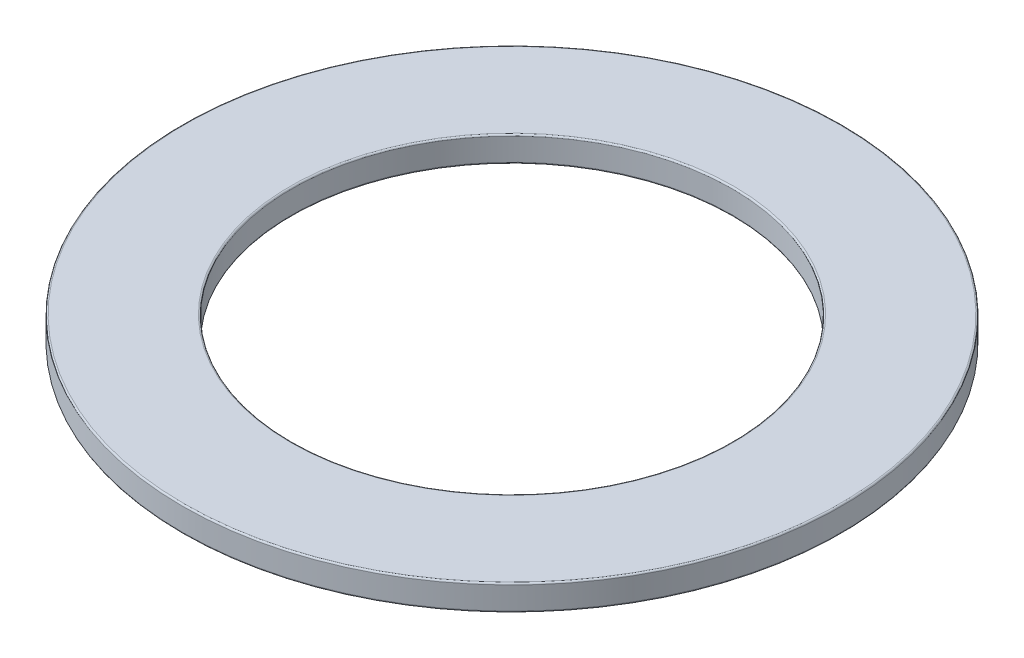
ISO-10303-21;
HEADER;
FILE_DESCRIPTION(('STEP AP214'),'2;1');
FILE_NAME('part.step','',(''),(''),'','','');
FILE_SCHEMA(('AUTOMOTIVE_DESIGN { 1 0 10303 214 1 1 1 1 }'));
ENDSEC;
DATA;
#1=APPLICATION_CONTEXT('core data for automotive mechanical design processes');
#2=APPLICATION_PROTOCOL_DEFINITION('international standard','automotive_design',2000,#1);
#3=PRODUCT_CONTEXT('',#1,'mechanical');
#4=PRODUCT('Part','Part','',(#3));
#5=PRODUCT_RELATED_PRODUCT_CATEGORY('part','',(#4));
#6=PRODUCT_DEFINITION_FORMATION('','',#4);
#7=PRODUCT_DEFINITION_CONTEXT('part definition',#1,'design');
#8=PRODUCT_DEFINITION('design','',#6,#7);
#9=PRODUCT_DEFINITION_SHAPE('','',#8);
#10=(LENGTH_UNIT() NAMED_UNIT(*) SI_UNIT(.MILLI.,.METRE.));
#11=(NAMED_UNIT(*) PLANE_ANGLE_UNIT() SI_UNIT($,.RADIAN.));
#12=(NAMED_UNIT(*) SI_UNIT($,.STERADIAN.) SOLID_ANGLE_UNIT());
#13=UNCERTAINTY_MEASURE_WITH_UNIT(LENGTH_MEASURE(1.E-05),#10,'distance_accuracy_value','');
#14=(GEOMETRIC_REPRESENTATION_CONTEXT(3) GLOBAL_UNCERTAINTY_ASSIGNED_CONTEXT((#13)) GLOBAL_UNIT_ASSIGNED_CONTEXT((#10,
#11,#12)) REPRESENTATION_CONTEXT('',''));
#15=CARTESIAN_POINT('',(0.,0.,0.));
#16=DIRECTION('',(0.,0.,1.));
#17=DIRECTION('',(1.,0.,0.));
#18=AXIS2_PLACEMENT_3D('',#15,#16,#17);
#19=CARTESIAN_POINT('',(0.,-5.5499,0.));
#20=DIRECTION('',(0.,-1.,0.));
#21=DIRECTION('',(0.,0.,-1.));
#22=AXIS2_PLACEMENT_3D('',#19,#20,#21);
#23=CYLINDRICAL_SURFACE('',#22,23.8125);
#24=CARTESIAN_POINT('',(0.,-5.438902,0.));
#25=DIRECTION('',(0.,1.,0.));
#26=DIRECTION('',(0.,0.,1.));
#27=AXIS2_PLACEMENT_3D('',#24,#25,#26);
#28=CIRCLE('',#27,23.8125);
#29=CARTESIAN_POINT('',(0.,-5.438902,23.8125));
#30=VERTEX_POINT('',#29);
#31=EDGE_CURVE('E10',#30,#30,#28,.T.);
#32=ORIENTED_EDGE('',*,*,#31,.T.);
#33=EDGE_LOOP('',(#32));
#34=FACE_BOUND('',#33,.T.);
#35=CARTESIAN_POINT('',(0.,-3.810931291,0.));
#36=DIRECTION('',(0.,-1.,0.));
#37=DIRECTION('',(0.,0.,-1.));
#38=AXIS2_PLACEMENT_3D('',#35,#36,#37);
#39=CIRCLE('',#38,23.8125);
#40=CARTESIAN_POINT('',(0.,-3.810931291,-23.8125));
#41=VERTEX_POINT('',#40);
#42=EDGE_CURVE('E40',#41,#41,#39,.T.);
#43=ORIENTED_EDGE('',*,*,#42,.T.);
#44=EDGE_LOOP('',(#43));
#45=FACE_BOUND('',#44,.T.);
#46=ADVANCED_FACE('F33',(#34,#45),#23,.T.);
#47=CARTESIAN_POINT('',(0.,-3.699933291,23.8125));
#48=DIRECTION('',(0.,-1.,0.));
#49=DIRECTION('',(0.,0.,-1.));
#50=AXIS2_PLACEMENT_3D('',#47,#48,#49);
#51=PLANE('',#50);
#52=CARTESIAN_POINT('',(0.,-3.699933291,0.));
#53=DIRECTION('',(0.,-1.,0.));
#54=DIRECTION('',(0.,0.,-1.));
#55=AXIS2_PLACEMENT_3D('',#52,#53,#54);
#56=CIRCLE('',#55,16.024098);
#57=CARTESIAN_POINT('',(0.,-3.699933291,-16.024098));
#58=VERTEX_POINT('',#57);
#59=EDGE_CURVE('E44',#58,#58,#56,.T.);
#60=ORIENTED_EDGE('',*,*,#59,.T.);
#61=EDGE_LOOP('',(#60));
#62=FACE_BOUND('',#61,.T.);
#63=CARTESIAN_POINT('',(0.,-3.699933291,0.));
#64=DIRECTION('',(0.,-1.,0.));
#65=DIRECTION('',(0.,0.,-1.));
#66=AXIS2_PLACEMENT_3D('',#63,#64,#65);
#67=CIRCLE('',#66,23.701502);
#68=CARTESIAN_POINT('',(0.,-3.699933291,-23.701502));
#69=VERTEX_POINT('',#68);
#70=EDGE_CURVE('E48',#69,#69,#67,.F.);
#71=ORIENTED_EDGE('',*,*,#70,.T.);
#72=EDGE_LOOP('',(#71));
#73=FACE_BOUND('',#72,.T.);
#74=ADVANCED_FACE('F76',(#62,#73),#51,.F.);
#75=CARTESIAN_POINT('',(0.,-5.5499,0.));
#76=DIRECTION('',(0.,-1.,0.));
#77=DIRECTION('',(0.,0.,-1.));
#78=AXIS2_PLACEMENT_3D('',#75,#76,#77);
#79=CYLINDRICAL_SURFACE('',#78,15.9131);
#80=CARTESIAN_POINT('',(0.,-5.438902,0.));
#81=DIRECTION('',(0.,1.,0.));
#82=DIRECTION('',(0.,0.,1.));
#83=AXIS2_PLACEMENT_3D('',#80,#81,#82);
#84=CIRCLE('',#83,15.9131);
#85=CARTESIAN_POINT('',(0.,-5.438902,15.9131));
#86=VERTEX_POINT('',#85);
#87=EDGE_CURVE('E59',#86,#86,#84,.F.);
#88=ORIENTED_EDGE('',*,*,#87,.T.);
#89=EDGE_LOOP('',(#88));
#90=FACE_BOUND('',#89,.T.);
#91=CARTESIAN_POINT('',(0.,-3.810931291,0.));
#92=DIRECTION('',(0.,-1.,0.));
#93=DIRECTION('',(0.,0.,-1.));
#94=AXIS2_PLACEMENT_3D('',#91,#92,#93);
#95=CIRCLE('',#94,15.9131);
#96=CARTESIAN_POINT('',(0.,-3.810931291,-15.9131));
#97=VERTEX_POINT('',#96);
#98=EDGE_CURVE('E62',#97,#97,#95,.F.);
#99=ORIENTED_EDGE('',*,*,#98,.T.);
#100=EDGE_LOOP('',(#99));
#101=FACE_BOUND('',#100,.T.);
#102=ADVANCED_FACE('F66',(#90,#101),#79,.F.);
#103=CARTESIAN_POINT('',(0.,-5.5499,23.8125));
#104=DIRECTION('',(0.,1.,0.));
#105=DIRECTION('',(0.,0.,1.));
#106=AXIS2_PLACEMENT_3D('',#103,#104,#105);
#107=PLANE('',#106);
#108=CARTESIAN_POINT('',(0.,-5.5499,0.));
#109=DIRECTION('',(0.,1.,0.));
#110=DIRECTION('',(0.,0.,1.));
#111=AXIS2_PLACEMENT_3D('',#108,#109,#110);
#112=CIRCLE('',#111,16.024098);
#113=CARTESIAN_POINT('',(0.,-5.5499,16.024098));
#114=VERTEX_POINT('',#113);
#115=EDGE_CURVE('E53',#114,#114,#112,.T.);
#116=ORIENTED_EDGE('',*,*,#115,.T.);
#117=EDGE_LOOP('',(#116));
#118=FACE_BOUND('',#117,.T.);
#119=CARTESIAN_POINT('',(0.,-5.5499,0.));
#120=DIRECTION('',(0.,1.,0.));
#121=DIRECTION('',(0.,0.,1.));
#122=AXIS2_PLACEMENT_3D('',#119,#120,#121);
#123=CIRCLE('',#122,23.701502);
#124=CARTESIAN_POINT('',(0.,-5.5499,23.701502));
#125=VERTEX_POINT('',#124);
#126=EDGE_CURVE('E56',#125,#125,#123,.F.);
#127=ORIENTED_EDGE('',*,*,#126,.T.);
#128=EDGE_LOOP('',(#127));
#129=FACE_BOUND('',#128,.T.);
#130=ADVANCED_FACE('F95',(#118,#129),#107,.F.);
#131=CARTESIAN_POINT('',(0.,-5.438902,0.));
#132=DIRECTION('',(0.,1.,0.));
#133=DIRECTION('',(0.,0.,1.));
#134=AXIS2_PLACEMENT_3D('',#131,#132,#133);
#135=TOROIDAL_SURFACE('',#134,16.024098,0.110998);
#136=ORIENTED_EDGE('',*,*,#115,.F.);
#137=EDGE_LOOP('',(#136));
#138=FACE_BOUND('',#137,.T.);
#139=ORIENTED_EDGE('',*,*,#87,.F.);
#140=EDGE_LOOP('',(#139));
#141=FACE_BOUND('',#140,.T.);
#142=ADVANCED_FACE('F72',(#138,#141),#135,.T.);
#143=CARTESIAN_POINT('',(0.,-3.810931291,0.));
#144=DIRECTION('',(0.,-1.,0.));
#145=DIRECTION('',(0.,0.,-1.));
#146=AXIS2_PLACEMENT_3D('',#143,#144,#145);
#147=TOROIDAL_SURFACE('',#146,16.024098,0.110998);
#148=ORIENTED_EDGE('',*,*,#98,.F.);
#149=EDGE_LOOP('',(#148));
#150=FACE_BOUND('',#149,.T.);
#151=ORIENTED_EDGE('',*,*,#59,.F.);
#152=EDGE_LOOP('',(#151));
#153=FACE_BOUND('',#152,.T.);
#154=ADVANCED_FACE('F68',(#150,#153),#147,.T.);
#155=CARTESIAN_POINT('',(0.,-5.438902,0.));
#156=DIRECTION('',(0.,1.,0.));
#157=DIRECTION('',(0.,0.,1.));
#158=AXIS2_PLACEMENT_3D('',#155,#156,#157);
#159=TOROIDAL_SURFACE('',#158,23.701502,0.110998);
#160=ORIENTED_EDGE('',*,*,#31,.F.);
#161=EDGE_LOOP('',(#160));
#162=FACE_BOUND('',#161,.T.);
#163=ORIENTED_EDGE('',*,*,#126,.F.);
#164=EDGE_LOOP('',(#163));
#165=FACE_BOUND('',#164,.T.);
#166=ADVANCED_FACE('F71',(#162,#165),#159,.T.);
#167=CARTESIAN_POINT('',(0.,-3.810931291,0.));
#168=DIRECTION('',(0.,-1.,0.));
#169=DIRECTION('',(0.,0.,-1.));
#170=AXIS2_PLACEMENT_3D('',#167,#168,#169);
#171=TOROIDAL_SURFACE('',#170,23.701502,0.110998);
#172=ORIENTED_EDGE('',*,*,#70,.F.);
#173=EDGE_LOOP('',(#172));
#174=FACE_BOUND('',#173,.T.);
#175=ORIENTED_EDGE('',*,*,#42,.F.);
#176=EDGE_LOOP('',(#175));
#177=FACE_BOUND('',#176,.T.);
#178=ADVANCED_FACE('F35',(#174,#177),#171,.T.);
#179=CLOSED_SHELL('',(#46,#74,#102,#130,#142,#154,#166,#178));
#180=MANIFOLD_SOLID_BREP('B2',#179);
#181=ADVANCED_BREP_SHAPE_REPRESENTATION('',(#18,#180),#14);
#182=SHAPE_DEFINITION_REPRESENTATION(#9,#181);
ENDSEC;
END-ISO-10303-21;
